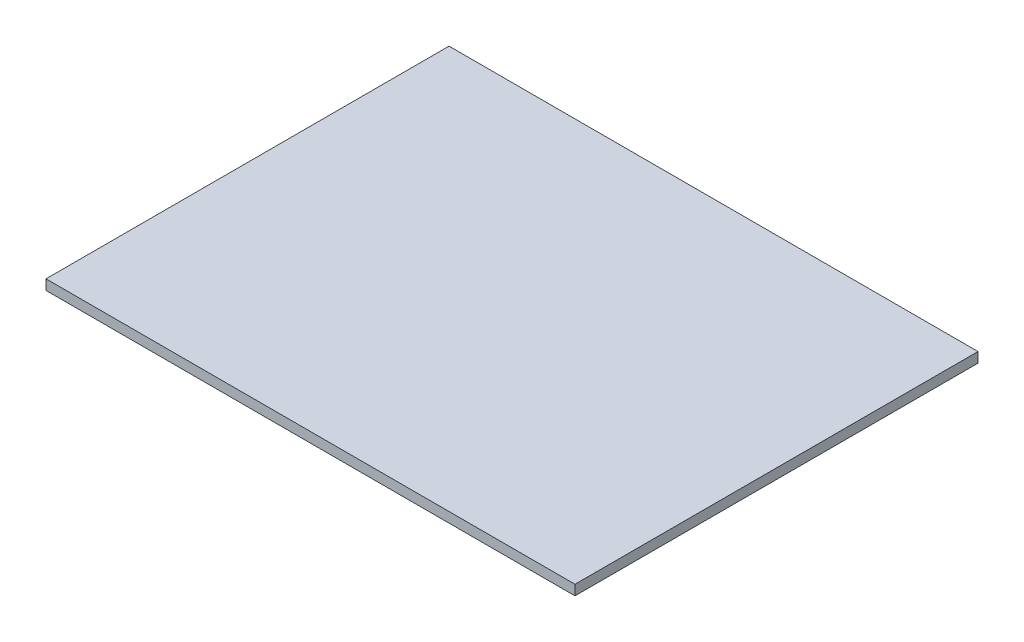
ISO-10303-21;
HEADER;
FILE_DESCRIPTION(('STEP AP214'),'2;1');
FILE_NAME('part.step','',(''),(''),'','','');
FILE_SCHEMA(('AUTOMOTIVE_DESIGN { 1 0 10303 214 1 1 1 1 }'));
ENDSEC;
DATA;
#1=APPLICATION_CONTEXT('core data for automotive mechanical design processes');
#2=APPLICATION_PROTOCOL_DEFINITION('international standard','automotive_design',2000,#1);
#3=PRODUCT_CONTEXT('',#1,'mechanical');
#4=PRODUCT('Part','Part','',(#3));
#5=PRODUCT_RELATED_PRODUCT_CATEGORY('part','',(#4));
#6=PRODUCT_DEFINITION_FORMATION('','',#4);
#7=PRODUCT_DEFINITION_CONTEXT('part definition',#1,'design');
#8=PRODUCT_DEFINITION('design','',#6,#7);
#9=PRODUCT_DEFINITION_SHAPE('','',#8);
#10=(LENGTH_UNIT() NAMED_UNIT(*) SI_UNIT(.MILLI.,.METRE.));
#11=(NAMED_UNIT(*) PLANE_ANGLE_UNIT() SI_UNIT($,.RADIAN.));
#12=(NAMED_UNIT(*) SI_UNIT($,.STERADIAN.) SOLID_ANGLE_UNIT());
#13=UNCERTAINTY_MEASURE_WITH_UNIT(LENGTH_MEASURE(1.E-05),#10,'distance_accuracy_value','');
#14=(GEOMETRIC_REPRESENTATION_CONTEXT(3) GLOBAL_UNCERTAINTY_ASSIGNED_CONTEXT((#13)) GLOBAL_UNIT_ASSIGNED_CONTEXT((#10,
#11,#12)) REPRESENTATION_CONTEXT('',''));
#15=CARTESIAN_POINT('',(0.,0.,0.));
#16=DIRECTION('',(0.,0.,1.));
#17=DIRECTION('',(1.,0.,0.));
#18=AXIS2_PLACEMENT_3D('',#15,#16,#17);
#19=CARTESIAN_POINT('',(105.,4.,80.));
#20=DIRECTION('',(-1.,0.,0.));
#21=DIRECTION('',(0.,0.,1.));
#22=AXIS2_PLACEMENT_3D('',#19,#20,#21);
#23=PLANE('',#22);
#24=DIRECTION('',(0.,0.,-1.));
#25=VECTOR('',#24,1.);
#26=CARTESIAN_POINT('',(105.,0.,80.));
#27=LINE('',#26,#25);
#28=CARTESIAN_POINT('',(105.,0.,80.));
#29=VERTEX_POINT('',#28);
#30=CARTESIAN_POINT('',(105.,0.,-80.));
#31=VERTEX_POINT('',#30);
#32=EDGE_CURVE('E96',#29,#31,#27,.T.);
#33=ORIENTED_EDGE('',*,*,#32,.T.);
#34=DIRECTION('',(0.,-1.,0.));
#35=VECTOR('',#34,1.);
#36=CARTESIAN_POINT('',(105.,4.,-80.));
#37=LINE('',#36,#35);
#38=CARTESIAN_POINT('',(105.,4.,-80.));
#39=VERTEX_POINT('',#38);
#40=EDGE_CURVE('E11',#39,#31,#37,.T.);
#41=ORIENTED_EDGE('',*,*,#40,.F.);
#42=DIRECTION('',(0.,0.,-1.));
#43=VECTOR('',#42,1.);
#44=CARTESIAN_POINT('',(105.,4.,80.));
#45=LINE('',#44,#43);
#46=CARTESIAN_POINT('',(105.,4.,80.));
#47=VERTEX_POINT('',#46);
#48=EDGE_CURVE('E84',#47,#39,#45,.T.);
#49=ORIENTED_EDGE('',*,*,#48,.F.);
#50=DIRECTION('',(0.,-1.,0.));
#51=VECTOR('',#50,1.);
#52=CARTESIAN_POINT('',(105.,4.,80.));
#53=LINE('',#52,#51);
#54=EDGE_CURVE('E92',#47,#29,#53,.T.);
#55=ORIENTED_EDGE('',*,*,#54,.T.);
#56=EDGE_LOOP('',(#33,#41,#49,#55));
#57=FACE_BOUND('',#56,.T.);
#58=ADVANCED_FACE('F33',(#57),#23,.F.);
#59=CARTESIAN_POINT('',(-105.,4.,-80.));
#60=DIRECTION('',(0.,0.,1.));
#61=DIRECTION('',(1.,0.,0.));
#62=AXIS2_PLACEMENT_3D('',#59,#60,#61);
#63=PLANE('',#62);
#64=DIRECTION('',(-1.,0.,0.));
#65=VECTOR('',#64,1.);
#66=CARTESIAN_POINT('',(-105.,0.,-80.));
#67=LINE('',#66,#65);
#68=CARTESIAN_POINT('',(-105.,0.,-80.));
#69=VERTEX_POINT('',#68);
#70=EDGE_CURVE('E88',#31,#69,#67,.T.);
#71=ORIENTED_EDGE('',*,*,#70,.T.);
#72=DIRECTION('',(0.,-1.,0.));
#73=VECTOR('',#72,1.);
#74=CARTESIAN_POINT('',(-105.,4.,-80.));
#75=LINE('',#74,#73);
#76=CARTESIAN_POINT('',(-105.,4.,-80.));
#77=VERTEX_POINT('',#76);
#78=EDGE_CURVE('E41',#77,#69,#75,.T.);
#79=ORIENTED_EDGE('',*,*,#78,.F.);
#80=DIRECTION('',(-1.,0.,0.));
#81=VECTOR('',#80,1.);
#82=CARTESIAN_POINT('',(-105.,4.,-80.));
#83=LINE('',#82,#81);
#84=EDGE_CURVE('E79',#39,#77,#83,.T.);
#85=ORIENTED_EDGE('',*,*,#84,.F.);
#86=ORIENTED_EDGE('',*,*,#40,.T.);
#87=EDGE_LOOP('',(#71,#79,#85,#86));
#88=FACE_BOUND('',#87,.T.);
#89=ADVANCED_FACE('F87',(#88),#63,.F.);
#90=CARTESIAN_POINT('',(-105.,4.,80.));
#91=DIRECTION('',(1.,0.,0.));
#92=DIRECTION('',(0.,0.,-1.));
#93=AXIS2_PLACEMENT_3D('',#90,#91,#92);
#94=PLANE('',#93);
#95=DIRECTION('',(0.,0.,1.));
#96=VECTOR('',#95,1.);
#97=CARTESIAN_POINT('',(-105.,0.,80.));
#98=LINE('',#97,#96);
#99=CARTESIAN_POINT('',(-105.,0.,80.));
#100=VERTEX_POINT('',#99);
#101=EDGE_CURVE('E66',#69,#100,#98,.T.);
#102=ORIENTED_EDGE('',*,*,#101,.T.);
#103=DIRECTION('',(0.,-1.,0.));
#104=VECTOR('',#103,1.);
#105=CARTESIAN_POINT('',(-105.,4.,80.));
#106=LINE('',#105,#104);
#107=CARTESIAN_POINT('',(-105.,4.,80.));
#108=VERTEX_POINT('',#107);
#109=EDGE_CURVE('E89',#108,#100,#106,.T.);
#110=ORIENTED_EDGE('',*,*,#109,.F.);
#111=DIRECTION('',(0.,0.,1.));
#112=VECTOR('',#111,1.);
#113=CARTESIAN_POINT('',(-105.,4.,80.));
#114=LINE('',#113,#112);
#115=EDGE_CURVE('E82',#77,#108,#114,.T.);
#116=ORIENTED_EDGE('',*,*,#115,.F.);
#117=ORIENTED_EDGE('',*,*,#78,.T.);
#118=EDGE_LOOP('',(#102,#110,#116,#117));
#119=FACE_BOUND('',#118,.T.);
#120=ADVANCED_FACE('F90',(#119),#94,.F.);
#121=CARTESIAN_POINT('',(-105.,4.,80.));
#122=DIRECTION('',(0.,0.,-1.));
#123=DIRECTION('',(-1.,0.,0.));
#124=AXIS2_PLACEMENT_3D('',#121,#122,#123);
#125=PLANE('',#124);
#126=DIRECTION('',(1.,0.,0.));
#127=VECTOR('',#126,1.);
#128=CARTESIAN_POINT('',(-105.,0.,80.));
#129=LINE('',#128,#127);
#130=EDGE_CURVE('E72',#100,#29,#129,.T.);
#131=ORIENTED_EDGE('',*,*,#130,.T.);
#132=ORIENTED_EDGE('',*,*,#54,.F.);
#133=DIRECTION('',(1.,0.,0.));
#134=VECTOR('',#133,1.);
#135=CARTESIAN_POINT('',(-105.,4.,80.));
#136=LINE('',#135,#134);
#137=EDGE_CURVE('E49',#108,#47,#136,.T.);
#138=ORIENTED_EDGE('',*,*,#137,.F.);
#139=ORIENTED_EDGE('',*,*,#109,.T.);
#140=EDGE_LOOP('',(#131,#132,#138,#139));
#141=FACE_BOUND('',#140,.T.);
#142=ADVANCED_FACE('F103',(#141),#125,.F.);
#143=CARTESIAN_POINT('',(0.,4.,0.));
#144=DIRECTION('',(0.,-1.,0.));
#145=DIRECTION('',(0.,0.,-1.));
#146=AXIS2_PLACEMENT_3D('',#143,#144,#145);
#147=PLANE('',#146);
#148=ORIENTED_EDGE('',*,*,#48,.T.);
#149=ORIENTED_EDGE('',*,*,#84,.T.);
#150=ORIENTED_EDGE('',*,*,#115,.T.);
#151=ORIENTED_EDGE('',*,*,#137,.T.);
#152=EDGE_LOOP('',(#148,#149,#150,#151));
#153=FACE_BOUND('',#152,.T.);
#154=ADVANCED_FACE('F80',(#153),#147,.F.);
#155=CARTESIAN_POINT('',(0.,0.,0.));
#156=DIRECTION('',(0.,-1.,0.));
#157=DIRECTION('',(0.,0.,-1.));
#158=AXIS2_PLACEMENT_3D('',#155,#156,#157);
#159=PLANE('',#158);
#160=ORIENTED_EDGE('',*,*,#32,.F.);
#161=ORIENTED_EDGE('',*,*,#130,.F.);
#162=ORIENTED_EDGE('',*,*,#101,.F.);
#163=ORIENTED_EDGE('',*,*,#70,.F.);
#164=EDGE_LOOP('',(#160,#161,#162,#163));
#165=FACE_BOUND('',#164,.T.);
#166=ADVANCED_FACE('F106',(#165),#159,.T.);
#167=CLOSED_SHELL('',(#58,#89,#120,#142,#154,#166));
#168=MANIFOLD_SOLID_BREP('B2',#167);
#169=ADVANCED_BREP_SHAPE_REPRESENTATION('',(#18,#168),#14);
#170=SHAPE_DEFINITION_REPRESENTATION(#9,#169);
ENDSEC;
END-ISO-10303-21;
